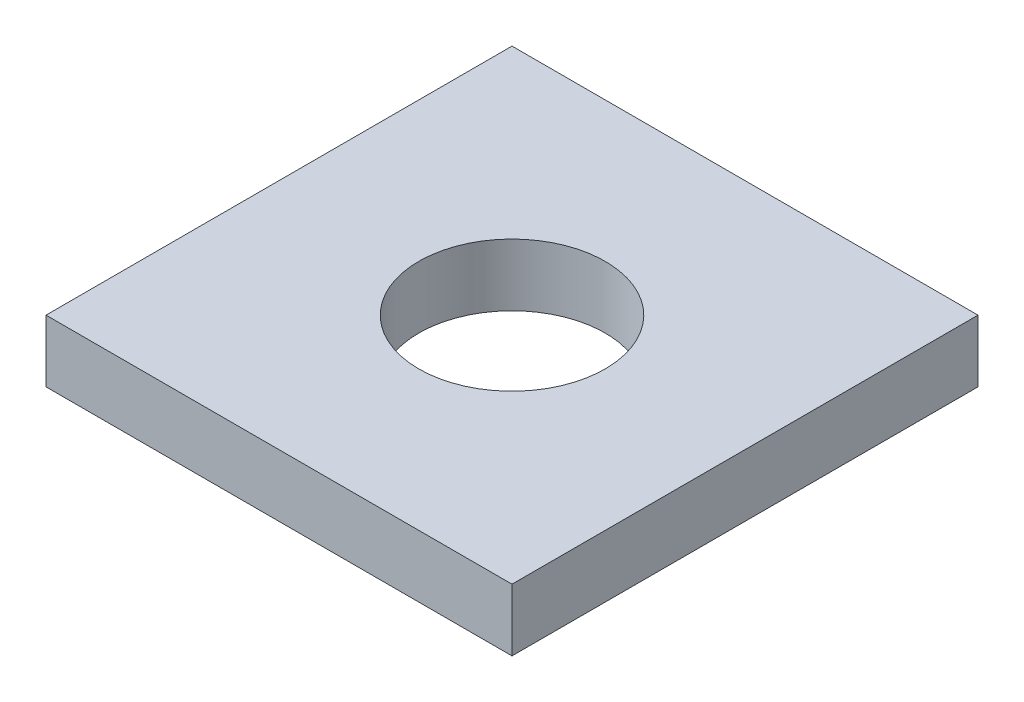
ISO-10303-21;
HEADER;
FILE_DESCRIPTION(('STEP AP214'),'2;1');
FILE_NAME('part.step','',(''),(''),'','','');
FILE_SCHEMA(('AUTOMOTIVE_DESIGN { 1 0 10303 214 1 1 1 1 }'));
ENDSEC;
DATA;
#1=APPLICATION_CONTEXT('core data for automotive mechanical design processes');
#2=APPLICATION_PROTOCOL_DEFINITION('international standard','automotive_design',2000,#1);
#3=PRODUCT_CONTEXT('',#1,'mechanical');
#4=PRODUCT('Part','Part','',(#3));
#5=PRODUCT_RELATED_PRODUCT_CATEGORY('part','',(#4));
#6=PRODUCT_DEFINITION_FORMATION('','',#4);
#7=PRODUCT_DEFINITION_CONTEXT('part definition',#1,'design');
#8=PRODUCT_DEFINITION('design','',#6,#7);
#9=PRODUCT_DEFINITION_SHAPE('','',#8);
#10=(LENGTH_UNIT() NAMED_UNIT(*) SI_UNIT(.MILLI.,.METRE.));
#11=(NAMED_UNIT(*) PLANE_ANGLE_UNIT() SI_UNIT($,.RADIAN.));
#12=(NAMED_UNIT(*) SI_UNIT($,.STERADIAN.) SOLID_ANGLE_UNIT());
#13=UNCERTAINTY_MEASURE_WITH_UNIT(LENGTH_MEASURE(1.E-05),#10,'distance_accuracy_value','');
#14=(GEOMETRIC_REPRESENTATION_CONTEXT(3) GLOBAL_UNCERTAINTY_ASSIGNED_CONTEXT((#13)) GLOBAL_UNIT_ASSIGNED_CONTEXT((#10,
#11,#12)) REPRESENTATION_CONTEXT('',''));
#15=CARTESIAN_POINT('',(0.,0.,0.));
#16=DIRECTION('',(0.,0.,1.));
#17=DIRECTION('',(1.,0.,0.));
#18=AXIS2_PLACEMENT_3D('',#15,#16,#17);
#19=CARTESIAN_POINT('',(0.,1.016,0.));
#20=DIRECTION('',(0.,-1.,0.));
#21=DIRECTION('',(0.,0.,-1.));
#22=AXIS2_PLACEMENT_3D('',#19,#20,#21);
#23=PLANE('',#22);
#24=DIRECTION('',(0.,0.,1.));
#25=VECTOR('',#24,1.);
#26=CARTESIAN_POINT('',(-3.81,1.016,-3.81));
#27=LINE('',#26,#25);
#28=CARTESIAN_POINT('',(-3.81,1.016,-3.81));
#29=VERTEX_POINT('',#28);
#30=CARTESIAN_POINT('',(-3.81,1.016,3.81));
#31=VERTEX_POINT('',#30);
#32=EDGE_CURVE('E84',#29,#31,#27,.T.);
#33=ORIENTED_EDGE('',*,*,#32,.T.);
#34=DIRECTION('',(1.,0.,0.));
#35=VECTOR('',#34,1.);
#36=CARTESIAN_POINT('',(3.81,1.016,3.81));
#37=LINE('',#36,#35);
#38=CARTESIAN_POINT('',(3.81,1.016,3.81));
#39=VERTEX_POINT('',#38);
#40=EDGE_CURVE('E79',#31,#39,#37,.T.);
#41=ORIENTED_EDGE('',*,*,#40,.T.);
#42=DIRECTION('',(0.,0.,-1.));
#43=VECTOR('',#42,1.);
#44=CARTESIAN_POINT('',(3.81,1.016,-3.81));
#45=LINE('',#44,#43);
#46=CARTESIAN_POINT('',(3.81,1.016,-3.81));
#47=VERTEX_POINT('',#46);
#48=EDGE_CURVE('E82',#39,#47,#45,.T.);
#49=ORIENTED_EDGE('',*,*,#48,.T.);
#50=DIRECTION('',(-1.,0.,0.));
#51=VECTOR('',#50,1.);
#52=CARTESIAN_POINT('',(3.81,1.016,-3.81));
#53=LINE('',#52,#51);
#54=EDGE_CURVE('E49',#47,#29,#53,.T.);
#55=ORIENTED_EDGE('',*,*,#54,.T.);
#56=EDGE_LOOP('',(#33,#41,#49,#55));
#57=FACE_BOUND('',#56,.T.);
#58=CARTESIAN_POINT('',(0.,1.016,0.));
#59=DIRECTION('',(0.,1.,0.));
#60=DIRECTION('',(0.,0.,1.));
#61=AXIS2_PLACEMENT_3D('',#58,#59,#60);
#62=CIRCLE('',#61,1.524);
#63=CARTESIAN_POINT('',(0.,1.016,1.524));
#64=VERTEX_POINT('',#63);
#65=EDGE_CURVE('E99',#64,#64,#62,.T.);
#66=ORIENTED_EDGE('',*,*,#65,.F.);
#67=EDGE_LOOP('',(#66));
#68=FACE_BOUND('',#67,.T.);
#69=ADVANCED_FACE('F32',(#57,#68),#23,.F.);
#70=CARTESIAN_POINT('',(0.,0.,0.));
#71=DIRECTION('',(0.,-1.,0.));
#72=DIRECTION('',(0.,0.,-1.));
#73=AXIS2_PLACEMENT_3D('',#70,#71,#72);
#74=PLANE('',#73);
#75=DIRECTION('',(0.,0.,1.));
#76=VECTOR('',#75,1.);
#77=CARTESIAN_POINT('',(-3.81,0.,-3.81));
#78=LINE('',#77,#76);
#79=CARTESIAN_POINT('',(-3.81,0.,-3.81));
#80=VERTEX_POINT('',#79);
#81=CARTESIAN_POINT('',(-3.81,0.,3.81));
#82=VERTEX_POINT('',#81);
#83=EDGE_CURVE('E96',#80,#82,#78,.T.);
#84=ORIENTED_EDGE('',*,*,#83,.F.);
#85=DIRECTION('',(-1.,0.,0.));
#86=VECTOR('',#85,1.);
#87=CARTESIAN_POINT('',(3.81,0.,-3.81));
#88=LINE('',#87,#86);
#89=CARTESIAN_POINT('',(3.81,0.,-3.81));
#90=VERTEX_POINT('',#89);
#91=EDGE_CURVE('E72',#90,#80,#88,.T.);
#92=ORIENTED_EDGE('',*,*,#91,.F.);
#93=DIRECTION('',(0.,0.,-1.));
#94=VECTOR('',#93,1.);
#95=CARTESIAN_POINT('',(3.81,0.,-3.81));
#96=LINE('',#95,#94);
#97=CARTESIAN_POINT('',(3.81,0.,3.81));
#98=VERTEX_POINT('',#97);
#99=EDGE_CURVE('E66',#98,#90,#96,.T.);
#100=ORIENTED_EDGE('',*,*,#99,.F.);
#101=DIRECTION('',(1.,0.,0.));
#102=VECTOR('',#101,1.);
#103=CARTESIAN_POINT('',(3.81,0.,3.81));
#104=LINE('',#103,#102);
#105=EDGE_CURVE('E88',#82,#98,#104,.T.);
#106=ORIENTED_EDGE('',*,*,#105,.F.);
#107=EDGE_LOOP('',(#84,#92,#100,#106));
#108=FACE_BOUND('',#107,.T.);
#109=CARTESIAN_POINT('',(0.,0.,0.));
#110=DIRECTION('',(0.,1.,0.));
#111=DIRECTION('',(0.,0.,1.));
#112=AXIS2_PLACEMENT_3D('',#109,#110,#111);
#113=CIRCLE('',#112,1.524);
#114=CARTESIAN_POINT('',(0.,0.,1.524));
#115=VERTEX_POINT('',#114);
#116=EDGE_CURVE('E111',#115,#115,#113,.T.);
#117=ORIENTED_EDGE('',*,*,#116,.T.);
#118=EDGE_LOOP('',(#117));
#119=FACE_BOUND('',#118,.T.);
#120=ADVANCED_FACE('F107',(#108,#119),#74,.T.);
#121=CARTESIAN_POINT('',(-3.81,1.016,-3.81));
#122=DIRECTION('',(1.,0.,0.));
#123=DIRECTION('',(0.,0.,-1.));
#124=AXIS2_PLACEMENT_3D('',#121,#122,#123);
#125=PLANE('',#124);
#126=ORIENTED_EDGE('',*,*,#83,.T.);
#127=DIRECTION('',(0.,-1.,0.));
#128=VECTOR('',#127,1.);
#129=CARTESIAN_POINT('',(-3.81,1.016,3.81));
#130=LINE('',#129,#128);
#131=EDGE_CURVE('E11',#31,#82,#130,.T.);
#132=ORIENTED_EDGE('',*,*,#131,.F.);
#133=ORIENTED_EDGE('',*,*,#32,.F.);
#134=DIRECTION('',(0.,-1.,0.));
#135=VECTOR('',#134,1.);
#136=CARTESIAN_POINT('',(-3.81,1.016,-3.81));
#137=LINE('',#136,#135);
#138=EDGE_CURVE('E92',#29,#80,#137,.T.);
#139=ORIENTED_EDGE('',*,*,#138,.T.);
#140=EDGE_LOOP('',(#126,#132,#133,#139));
#141=FACE_BOUND('',#140,.T.);
#142=ADVANCED_FACE('F34',(#141),#125,.F.);
#143=CARTESIAN_POINT('',(3.81,1.016,3.81));
#144=DIRECTION('',(0.,0.,-1.));
#145=DIRECTION('',(-1.,0.,0.));
#146=AXIS2_PLACEMENT_3D('',#143,#144,#145);
#147=PLANE('',#146);
#148=ORIENTED_EDGE('',*,*,#105,.T.);
#149=DIRECTION('',(0.,-1.,0.));
#150=VECTOR('',#149,1.);
#151=CARTESIAN_POINT('',(3.81,1.016,3.81));
#152=LINE('',#151,#150);
#153=EDGE_CURVE('E41',#39,#98,#152,.T.);
#154=ORIENTED_EDGE('',*,*,#153,.F.);
#155=ORIENTED_EDGE('',*,*,#40,.F.);
#156=ORIENTED_EDGE('',*,*,#131,.T.);
#157=EDGE_LOOP('',(#148,#154,#155,#156));
#158=FACE_BOUND('',#157,.T.);
#159=ADVANCED_FACE('F87',(#158),#147,.F.);
#160=CARTESIAN_POINT('',(3.81,1.016,-3.81));
#161=DIRECTION('',(-1.,0.,0.));
#162=DIRECTION('',(0.,0.,1.));
#163=AXIS2_PLACEMENT_3D('',#160,#161,#162);
#164=PLANE('',#163);
#165=ORIENTED_EDGE('',*,*,#99,.T.);
#166=DIRECTION('',(0.,-1.,0.));
#167=VECTOR('',#166,1.);
#168=CARTESIAN_POINT('',(3.81,1.016,-3.81));
#169=LINE('',#168,#167);
#170=EDGE_CURVE('E89',#47,#90,#169,.T.);
#171=ORIENTED_EDGE('',*,*,#170,.F.);
#172=ORIENTED_EDGE('',*,*,#48,.F.);
#173=ORIENTED_EDGE('',*,*,#153,.T.);
#174=EDGE_LOOP('',(#165,#171,#172,#173));
#175=FACE_BOUND('',#174,.T.);
#176=ADVANCED_FACE('F90',(#175),#164,.F.);
#177=CARTESIAN_POINT('',(3.81,1.016,-3.81));
#178=DIRECTION('',(0.,0.,1.));
#179=DIRECTION('',(1.,0.,0.));
#180=AXIS2_PLACEMENT_3D('',#177,#178,#179);
#181=PLANE('',#180);
#182=ORIENTED_EDGE('',*,*,#91,.T.);
#183=ORIENTED_EDGE('',*,*,#138,.F.);
#184=ORIENTED_EDGE('',*,*,#54,.F.);
#185=ORIENTED_EDGE('',*,*,#170,.T.);
#186=EDGE_LOOP('',(#182,#183,#184,#185));
#187=FACE_BOUND('',#186,.T.);
#188=ADVANCED_FACE('F104',(#187),#181,.F.);
#189=CARTESIAN_POINT('',(0.,1.016,0.));
#190=DIRECTION('',(0.,-1.,0.));
#191=DIRECTION('',(0.,0.,-1.));
#192=AXIS2_PLACEMENT_3D('',#189,#190,#191);
#193=CYLINDRICAL_SURFACE('',#192,1.524);
#194=ORIENTED_EDGE('',*,*,#65,.T.);
#195=EDGE_LOOP('',(#194));
#196=FACE_BOUND('',#195,.T.);
#197=ORIENTED_EDGE('',*,*,#116,.F.);
#198=EDGE_LOOP('',(#197));
#199=FACE_BOUND('',#198,.T.);
#200=ADVANCED_FACE('F117',(#196,#199),#193,.F.);
#201=CLOSED_SHELL('',(#69,#120,#142,#159,#176,#188,#200));
#202=MANIFOLD_SOLID_BREP('B2',#201);
#203=ADVANCED_BREP_SHAPE_REPRESENTATION('',(#18,#202),#14);
#204=SHAPE_DEFINITION_REPRESENTATION(#9,#203);
ENDSEC;
END-ISO-10303-21;
